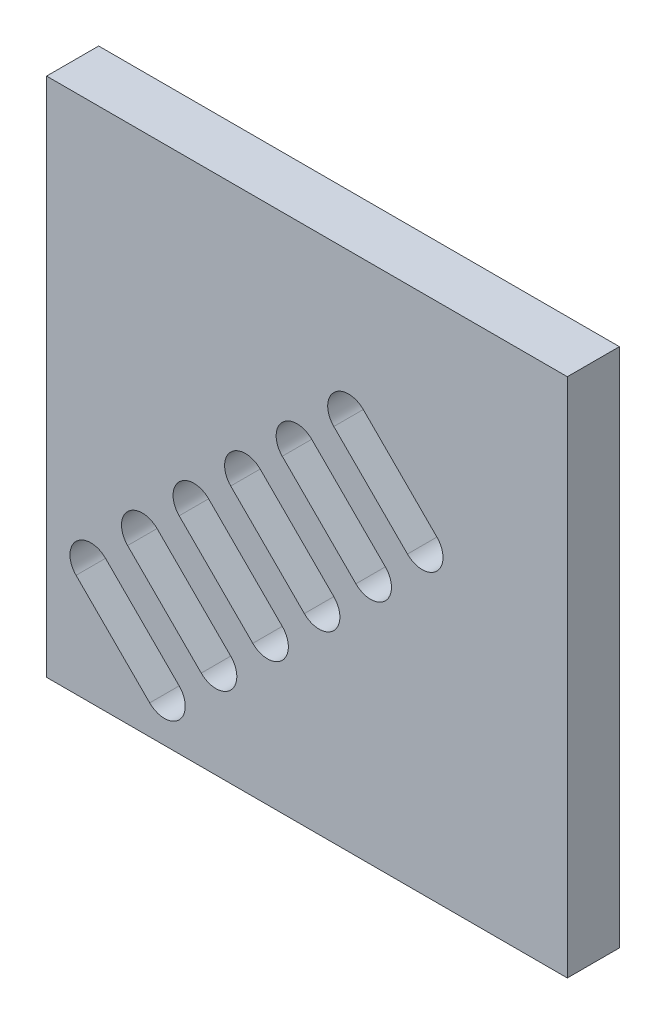
ISO-10303-21;
HEADER;
FILE_DESCRIPTION(('STEP AP214'),'2;1');
FILE_NAME('part.step','',(''),(''),'','','');
FILE_SCHEMA(('AUTOMOTIVE_DESIGN { 1 0 10303 214 1 1 1 1 }'));
ENDSEC;
DATA;
#1=APPLICATION_CONTEXT('core data for automotive mechanical design processes');
#2=APPLICATION_PROTOCOL_DEFINITION('international standard','automotive_design',2000,#1);
#3=PRODUCT_CONTEXT('',#1,'mechanical');
#4=PRODUCT('Part','Part','',(#3));
#5=PRODUCT_RELATED_PRODUCT_CATEGORY('part','',(#4));
#6=PRODUCT_DEFINITION_FORMATION('','',#4);
#7=PRODUCT_DEFINITION_CONTEXT('part definition',#1,'design');
#8=PRODUCT_DEFINITION('design','',#6,#7);
#9=PRODUCT_DEFINITION_SHAPE('','',#8);
#10=(LENGTH_UNIT() NAMED_UNIT(*) SI_UNIT(.MILLI.,.METRE.));
#11=(NAMED_UNIT(*) PLANE_ANGLE_UNIT() SI_UNIT($,.RADIAN.));
#12=(NAMED_UNIT(*) SI_UNIT($,.STERADIAN.) SOLID_ANGLE_UNIT());
#13=UNCERTAINTY_MEASURE_WITH_UNIT(LENGTH_MEASURE(1.E-05),#10,'distance_accuracy_value','');
#14=(GEOMETRIC_REPRESENTATION_CONTEXT(3) GLOBAL_UNCERTAINTY_ASSIGNED_CONTEXT((#13)) GLOBAL_UNIT_ASSIGNED_CONTEXT((#10,
#11,#12)) REPRESENTATION_CONTEXT('',''));
#15=CARTESIAN_POINT('',(0.,0.,0.));
#16=DIRECTION('',(0.,0.,1.));
#17=DIRECTION('',(1.,0.,0.));
#18=AXIS2_PLACEMENT_3D('',#15,#16,#17);
#19=CARTESIAN_POINT('',(10.8111831820431,24.953318805774,5.));
#20=DIRECTION('',(-0.707106781186547,-0.707106781186548,0.));
#21=DIRECTION('',(0.707106781186548,-0.707106781186547,0.));
#22=AXIS2_PLACEMENT_3D('',#19,#20,#21);
#23=PLANE('',#22);
#24=DIRECTION('',(-0.707106781186548,0.707106781186547,0.));
#25=VECTOR('',#24,1.);
#26=CARTESIAN_POINT('',(10.8111831820431,24.953318805774,-5.));
#27=LINE('',#26,#25);
#28=CARTESIAN_POINT('',(24.953318805774,10.8111831820431,-5.));
#29=VERTEX_POINT('',#28);
#30=CARTESIAN_POINT('',(10.8111831820431,24.953318805774,-5.));
#31=VERTEX_POINT('',#30);
#32=EDGE_CURVE('E44',#29,#31,#27,.T.);
#33=ORIENTED_EDGE('',*,*,#32,.F.);
#34=DIRECTION('',(0.,0.,-1.));
#35=VECTOR('',#34,1.);
#36=CARTESIAN_POINT('',(24.953318805774,10.8111831820431,5.));
#37=LINE('',#36,#35);
#38=CARTESIAN_POINT('',(24.953318805774,10.8111831820431,5.));
#39=VERTEX_POINT('',#38);
#40=EDGE_CURVE('E429',#39,#29,#37,.T.);
#41=ORIENTED_EDGE('',*,*,#40,.F.);
#42=DIRECTION('',(-0.707106781186548,0.707106781186547,0.));
#43=VECTOR('',#42,1.);
#44=CARTESIAN_POINT('',(10.8111831820431,24.953318805774,5.));
#45=LINE('',#44,#43);
#46=CARTESIAN_POINT('',(10.8111831820431,24.953318805774,5.));
#47=VERTEX_POINT('',#46);
#48=EDGE_CURVE('E11',#39,#47,#45,.T.);
#49=ORIENTED_EDGE('',*,*,#48,.T.);
#50=DIRECTION('',(0.,0.,-1.));
#51=VECTOR('',#50,1.);
#52=CARTESIAN_POINT('',(10.8111831820431,24.953318805774,5.));
#53=LINE('',#52,#51);
#54=EDGE_CURVE('E433',#47,#31,#53,.T.);
#55=ORIENTED_EDGE('',*,*,#54,.T.);
#56=EDGE_LOOP('',(#33,#41,#49,#55));
#57=FACE_BOUND('',#56,.T.);
#58=ADVANCED_FACE('F37',(#57),#23,.T.);
#59=CARTESIAN_POINT('',(5.1543289325507,19.2964645562816,5.));
#60=DIRECTION('',(0.707106781186548,0.707106781186547,0.));
#61=DIRECTION('',(-0.707106781186547,0.707106781186548,0.));
#62=AXIS2_PLACEMENT_3D('',#59,#60,#61);
#63=PLANE('',#62);
#64=DIRECTION('',(0.707106781186547,-0.707106781186548,0.));
#65=VECTOR('',#64,1.);
#66=CARTESIAN_POINT('',(5.1543289325507,19.2964645562816,-5.));
#67=LINE('',#66,#65);
#68=CARTESIAN_POINT('',(5.1543289325507,19.2964645562816,-5.));
#69=VERTEX_POINT('',#68);
#70=CARTESIAN_POINT('',(19.2964645562817,5.1543289325507,-5.));
#71=VERTEX_POINT('',#70);
#72=EDGE_CURVE('E439',#69,#71,#67,.T.);
#73=ORIENTED_EDGE('',*,*,#72,.F.);
#74=DIRECTION('',(0.,0.,-1.));
#75=VECTOR('',#74,1.);
#76=CARTESIAN_POINT('',(5.1543289325507,19.2964645562816,5.));
#77=LINE('',#76,#75);
#78=CARTESIAN_POINT('',(5.1543289325507,19.2964645562816,5.));
#79=VERTEX_POINT('',#78);
#80=EDGE_CURVE('E437',#79,#69,#77,.T.);
#81=ORIENTED_EDGE('',*,*,#80,.F.);
#82=DIRECTION('',(0.707106781186547,-0.707106781186548,0.));
#83=VECTOR('',#82,1.);
#84=CARTESIAN_POINT('',(5.1543289325507,19.2964645562816,5.));
#85=LINE('',#84,#83);
#86=CARTESIAN_POINT('',(19.2964645562817,5.1543289325507,5.));
#87=VERTEX_POINT('',#86);
#88=EDGE_CURVE('E441',#79,#87,#85,.T.);
#89=ORIENTED_EDGE('',*,*,#88,.T.);
#90=DIRECTION('',(0.,0.,-1.));
#91=VECTOR('',#90,1.);
#92=CARTESIAN_POINT('',(19.2964645562817,5.1543289325507,5.));
#93=LINE('',#92,#91);
#94=EDGE_CURVE('E424',#87,#71,#93,.T.);
#95=ORIENTED_EDGE('',*,*,#94,.T.);
#96=EDGE_LOOP('',(#73,#81,#89,#95));
#97=FACE_BOUND('',#96,.T.);
#98=ADVANCED_FACE('F456',(#97),#63,.T.);
#99=CARTESIAN_POINT('',(7.98275605729689,22.1248916810278,5.));
#100=DIRECTION('',(0.,0.,-1.));
#101=DIRECTION('',(-1.,0.,0.));
#102=AXIS2_PLACEMENT_3D('',#99,#100,#101);
#103=CYLINDRICAL_SURFACE('',#102,4.);
#104=CARTESIAN_POINT('',(7.98275605729689,22.1248916810278,-5.));
#105=DIRECTION('',(0.,0.,1.));
#106=DIRECTION('',(1.,0.,0.));
#107=AXIS2_PLACEMENT_3D('',#104,#105,#106);
#108=CIRCLE('',#107,4.);
#109=EDGE_CURVE('E51',#31,#69,#108,.T.);
#110=ORIENTED_EDGE('',*,*,#109,.F.);
#111=ORIENTED_EDGE('',*,*,#54,.F.);
#112=CARTESIAN_POINT('',(7.98275605729689,22.1248916810278,5.));
#113=DIRECTION('',(0.,0.,1.));
#114=DIRECTION('',(1.,0.,0.));
#115=AXIS2_PLACEMENT_3D('',#112,#113,#114);
#116=CIRCLE('',#115,4.);
#117=EDGE_CURVE('E58',#47,#79,#116,.T.);
#118=ORIENTED_EDGE('',*,*,#117,.T.);
#119=ORIENTED_EDGE('',*,*,#80,.T.);
#120=EDGE_LOOP('',(#110,#111,#118,#119));
#121=FACE_BOUND('',#120,.T.);
#122=ADVANCED_FACE('F449',(#121),#103,.F.);
#123=CARTESIAN_POINT('',(22.1248916810279,7.98275605729689,5.));
#124=DIRECTION('',(0.,0.,-1.));
#125=DIRECTION('',(-1.,0.,0.));
#126=AXIS2_PLACEMENT_3D('',#123,#124,#125);
#127=CYLINDRICAL_SURFACE('',#126,4.);
#128=CARTESIAN_POINT('',(22.1248916810279,7.98275605729689,-5.));
#129=DIRECTION('',(0.,0.,1.));
#130=DIRECTION('',(1.,0.,0.));
#131=AXIS2_PLACEMENT_3D('',#128,#129,#130);
#132=CIRCLE('',#131,4.);
#133=EDGE_CURVE('E422',#71,#29,#132,.T.);
#134=ORIENTED_EDGE('',*,*,#133,.F.);
#135=ORIENTED_EDGE('',*,*,#94,.F.);
#136=CARTESIAN_POINT('',(22.1248916810279,7.98275605729689,5.));
#137=DIRECTION('',(0.,0.,1.));
#138=DIRECTION('',(1.,0.,0.));
#139=AXIS2_PLACEMENT_3D('',#136,#137,#138);
#140=CIRCLE('',#139,4.);
#141=EDGE_CURVE('E427',#87,#39,#140,.T.);
#142=ORIENTED_EDGE('',*,*,#141,.T.);
#143=ORIENTED_EDGE('',*,*,#40,.T.);
#144=EDGE_LOOP('',(#134,#135,#142,#143));
#145=FACE_BOUND('',#144,.T.);
#146=ADVANCED_FACE('F458',(#145),#127,.F.);
#147=CARTESIAN_POINT('',(0.911688245431412,15.0538238691624,5.));
#148=DIRECTION('',(-0.707106781186547,-0.707106781186548,0.));
#149=DIRECTION('',(0.707106781186548,-0.707106781186547,0.));
#150=AXIS2_PLACEMENT_3D('',#147,#148,#149);
#151=PLANE('',#150);
#152=DIRECTION('',(-0.707106781186548,0.707106781186547,0.));
#153=VECTOR('',#152,1.);
#154=CARTESIAN_POINT('',(0.911688245431412,15.0538238691624,-5.));
#155=LINE('',#154,#153);
#156=CARTESIAN_POINT('',(15.0538238691624,0.911688245431412,-5.));
#157=VERTEX_POINT('',#156);
#158=CARTESIAN_POINT('',(0.911688245431412,15.0538238691624,-5.));
#159=VERTEX_POINT('',#158);
#160=EDGE_CURVE('E416',#157,#159,#155,.T.);
#161=ORIENTED_EDGE('',*,*,#160,.F.);
#162=DIRECTION('',(0.,0.,-1.));
#163=VECTOR('',#162,1.);
#164=CARTESIAN_POINT('',(15.0538238691624,0.911688245431412,5.));
#165=LINE('',#164,#163);
#166=CARTESIAN_POINT('',(15.0538238691624,0.911688245431412,5.));
#167=VERTEX_POINT('',#166);
#168=EDGE_CURVE('E397',#167,#157,#165,.T.);
#169=ORIENTED_EDGE('',*,*,#168,.F.);
#170=DIRECTION('',(-0.707106781186548,0.707106781186547,0.));
#171=VECTOR('',#170,1.);
#172=CARTESIAN_POINT('',(0.911688245431412,15.0538238691624,5.));
#173=LINE('',#172,#171);
#174=CARTESIAN_POINT('',(0.911688245431412,15.0538238691624,5.));
#175=VERTEX_POINT('',#174);
#176=EDGE_CURVE('E419',#167,#175,#173,.T.);
#177=ORIENTED_EDGE('',*,*,#176,.T.);
#178=DIRECTION('',(0.,0.,-1.));
#179=VECTOR('',#178,1.);
#180=CARTESIAN_POINT('',(0.911688245431412,15.0538238691624,5.));
#181=LINE('',#180,#179);
#182=EDGE_CURVE('E402',#175,#159,#181,.T.);
#183=ORIENTED_EDGE('',*,*,#182,.T.);
#184=EDGE_LOOP('',(#161,#169,#177,#183));
#185=FACE_BOUND('',#184,.T.);
#186=ADVANCED_FACE('F460',(#185),#151,.T.);
#187=CARTESIAN_POINT('',(-4.74516600406096,9.39696961966998,5.));
#188=DIRECTION('',(0.707106781186548,0.707106781186547,0.));
#189=DIRECTION('',(-0.707106781186547,0.707106781186548,0.));
#190=AXIS2_PLACEMENT_3D('',#187,#188,#189);
#191=PLANE('',#190);
#192=DIRECTION('',(0.707106781186547,-0.707106781186548,0.));
#193=VECTOR('',#192,1.);
#194=CARTESIAN_POINT('',(-4.74516600406096,9.39696961966998,-5.));
#195=LINE('',#194,#193);
#196=CARTESIAN_POINT('',(-4.74516600406096,9.39696961966998,-5.));
#197=VERTEX_POINT('',#196);
#198=CARTESIAN_POINT('',(9.39696961966999,-4.74516600406096,-5.));
#199=VERTEX_POINT('',#198);
#200=EDGE_CURVE('E410',#197,#199,#195,.T.);
#201=ORIENTED_EDGE('',*,*,#200,.F.);
#202=DIRECTION('',(0.,0.,-1.));
#203=VECTOR('',#202,1.);
#204=CARTESIAN_POINT('',(-4.74516600406096,9.39696961966998,5.));
#205=LINE('',#204,#203);
#206=CARTESIAN_POINT('',(-4.74516600406096,9.39696961966998,5.));
#207=VERTEX_POINT('',#206);
#208=EDGE_CURVE('E407',#207,#197,#205,.T.);
#209=ORIENTED_EDGE('',*,*,#208,.F.);
#210=DIRECTION('',(0.707106781186547,-0.707106781186548,0.));
#211=VECTOR('',#210,1.);
#212=CARTESIAN_POINT('',(-4.74516600406096,9.39696961966998,5.));
#213=LINE('',#212,#211);
#214=CARTESIAN_POINT('',(9.39696961966999,-4.74516600406096,5.));
#215=VERTEX_POINT('',#214);
#216=EDGE_CURVE('E413',#207,#215,#213,.T.);
#217=ORIENTED_EDGE('',*,*,#216,.T.);
#218=DIRECTION('',(0.,0.,-1.));
#219=VECTOR('',#218,1.);
#220=CARTESIAN_POINT('',(9.39696961966999,-4.74516600406096,5.));
#221=LINE('',#220,#219);
#222=EDGE_CURVE('E392',#215,#199,#221,.T.);
#223=ORIENTED_EDGE('',*,*,#222,.T.);
#224=EDGE_LOOP('',(#201,#209,#217,#223));
#225=FACE_BOUND('',#224,.T.);
#226=ADVANCED_FACE('F466',(#225),#191,.T.);
#227=CARTESIAN_POINT('',(-1.91673887931477,12.2253967444162,5.));
#228=DIRECTION('',(0.,0.,-1.));
#229=DIRECTION('',(-1.,0.,0.));
#230=AXIS2_PLACEMENT_3D('',#227,#228,#229);
#231=CYLINDRICAL_SURFACE('',#230,4.);
#232=CARTESIAN_POINT('',(-1.91673887931477,12.2253967444162,-5.));
#233=DIRECTION('',(0.,0.,1.));
#234=DIRECTION('',(1.,0.,0.));
#235=AXIS2_PLACEMENT_3D('',#232,#233,#234);
#236=CIRCLE('',#235,4.);
#237=EDGE_CURVE('E400',#159,#197,#236,.T.);
#238=ORIENTED_EDGE('',*,*,#237,.F.);
#239=ORIENTED_EDGE('',*,*,#182,.F.);
#240=CARTESIAN_POINT('',(-1.91673887931477,12.2253967444162,5.));
#241=DIRECTION('',(0.,0.,1.));
#242=DIRECTION('',(1.,0.,0.));
#243=AXIS2_PLACEMENT_3D('',#240,#241,#242);
#244=CIRCLE('',#243,4.);
#245=EDGE_CURVE('E405',#175,#207,#244,.T.);
#246=ORIENTED_EDGE('',*,*,#245,.T.);
#247=ORIENTED_EDGE('',*,*,#208,.T.);
#248=EDGE_LOOP('',(#238,#239,#246,#247));
#249=FACE_BOUND('',#248,.T.);
#250=ADVANCED_FACE('F499',(#249),#231,.F.);
#251=CARTESIAN_POINT('',(12.2253967444162,-1.91673887931477,5.));
#252=DIRECTION('',(0.,0.,-1.));
#253=DIRECTION('',(-1.,0.,0.));
#254=AXIS2_PLACEMENT_3D('',#251,#252,#253);
#255=CYLINDRICAL_SURFACE('',#254,4.);
#256=CARTESIAN_POINT('',(12.2253967444162,-1.91673887931477,-5.));
#257=DIRECTION('',(0.,0.,1.));
#258=DIRECTION('',(1.,0.,0.));
#259=AXIS2_PLACEMENT_3D('',#256,#257,#258);
#260=CIRCLE('',#259,4.);
#261=EDGE_CURVE('E390',#199,#157,#260,.T.);
#262=ORIENTED_EDGE('',*,*,#261,.F.);
#263=ORIENTED_EDGE('',*,*,#222,.F.);
#264=CARTESIAN_POINT('',(12.2253967444162,-1.91673887931477,5.));
#265=DIRECTION('',(0.,0.,1.));
#266=DIRECTION('',(1.,0.,0.));
#267=AXIS2_PLACEMENT_3D('',#264,#265,#266);
#268=CIRCLE('',#267,4.);
#269=EDGE_CURVE('E395',#215,#167,#268,.T.);
#270=ORIENTED_EDGE('',*,*,#269,.T.);
#271=ORIENTED_EDGE('',*,*,#168,.T.);
#272=EDGE_LOOP('',(#262,#263,#270,#271));
#273=FACE_BOUND('',#272,.T.);
#274=ADVANCED_FACE('F509',(#273),#255,.F.);
#275=CARTESIAN_POINT('',(-8.98780669118026,5.1543289325507,5.));
#276=DIRECTION('',(-0.707106781186547,-0.707106781186548,0.));
#277=DIRECTION('',(0.707106781186548,-0.707106781186547,0.));
#278=AXIS2_PLACEMENT_3D('',#275,#276,#277);
#279=PLANE('',#278);
#280=DIRECTION('',(-0.707106781186548,0.707106781186547,0.));
#281=VECTOR('',#280,1.);
#282=CARTESIAN_POINT('',(-8.98780669118026,5.1543289325507,-5.));
#283=LINE('',#282,#281);
#284=CARTESIAN_POINT('',(5.1543289325507,-8.98780669118025,-5.));
#285=VERTEX_POINT('',#284);
#286=CARTESIAN_POINT('',(-8.98780669118026,5.15432893255069,-5.));
#287=VERTEX_POINT('',#286);
#288=EDGE_CURVE('E384',#285,#287,#283,.T.);
#289=ORIENTED_EDGE('',*,*,#288,.F.);
#290=DIRECTION('',(0.,0.,-1.));
#291=VECTOR('',#290,1.);
#292=CARTESIAN_POINT('',(5.1543289325507,-8.98780669118025,5.));
#293=LINE('',#292,#291);
#294=CARTESIAN_POINT('',(5.1543289325507,-8.98780669118025,5.));
#295=VERTEX_POINT('',#294);
#296=EDGE_CURVE('E365',#295,#285,#293,.T.);
#297=ORIENTED_EDGE('',*,*,#296,.F.);
#298=DIRECTION('',(-0.707106781186548,0.707106781186547,0.));
#299=VECTOR('',#298,1.);
#300=CARTESIAN_POINT('',(-8.98780669118026,5.1543289325507,5.));
#301=LINE('',#300,#299);
#302=CARTESIAN_POINT('',(-8.98780669118026,5.1543289325507,5.));
#303=VERTEX_POINT('',#302);
#304=EDGE_CURVE('E387',#295,#303,#301,.T.);
#305=ORIENTED_EDGE('',*,*,#304,.T.);
#306=DIRECTION('',(0.,0.,-1.));
#307=VECTOR('',#306,1.);
#308=CARTESIAN_POINT('',(-8.98780669118026,5.1543289325507,5.));
#309=LINE('',#308,#307);
#310=EDGE_CURVE('E370',#303,#287,#309,.T.);
#311=ORIENTED_EDGE('',*,*,#310,.T.);
#312=EDGE_LOOP('',(#289,#297,#305,#311));
#313=FACE_BOUND('',#312,.T.);
#314=ADVANCED_FACE('F519',(#313),#279,.T.);
#315=CARTESIAN_POINT('',(-14.6446609406726,-0.502525316941681,5.));
#316=DIRECTION('',(0.707106781186548,0.707106781186547,0.));
#317=DIRECTION('',(-0.707106781186547,0.707106781186548,0.));
#318=AXIS2_PLACEMENT_3D('',#315,#316,#317);
#319=PLANE('',#318);
#320=DIRECTION('',(0.707106781186547,-0.707106781186548,0.));
#321=VECTOR('',#320,1.);
#322=CARTESIAN_POINT('',(-14.6446609406726,-0.502525316941681,-5.));
#323=LINE('',#322,#321);
#324=CARTESIAN_POINT('',(-14.6446609406726,-0.502525316941681,-5.));
#325=VERTEX_POINT('',#324);
#326=CARTESIAN_POINT('',(-0.502525316941674,-14.6446609406726,-5.));
#327=VERTEX_POINT('',#326);
#328=EDGE_CURVE('E378',#325,#327,#323,.T.);
#329=ORIENTED_EDGE('',*,*,#328,.F.);
#330=DIRECTION('',(0.,0.,-1.));
#331=VECTOR('',#330,1.);
#332=CARTESIAN_POINT('',(-14.6446609406726,-0.502525316941681,5.));
#333=LINE('',#332,#331);
#334=CARTESIAN_POINT('',(-14.6446609406726,-0.502525316941681,5.));
#335=VERTEX_POINT('',#334);
#336=EDGE_CURVE('E375',#335,#325,#333,.T.);
#337=ORIENTED_EDGE('',*,*,#336,.F.);
#338=DIRECTION('',(0.707106781186547,-0.707106781186548,0.));
#339=VECTOR('',#338,1.);
#340=CARTESIAN_POINT('',(-14.6446609406726,-0.502525316941681,5.));
#341=LINE('',#340,#339);
#342=CARTESIAN_POINT('',(-0.502525316941674,-14.6446609406726,5.));
#343=VERTEX_POINT('',#342);
#344=EDGE_CURVE('E381',#335,#343,#341,.T.);
#345=ORIENTED_EDGE('',*,*,#344,.T.);
#346=DIRECTION('',(0.,0.,-1.));
#347=VECTOR('',#346,1.);
#348=CARTESIAN_POINT('',(-0.502525316941674,-14.6446609406726,5.));
#349=LINE('',#348,#347);
#350=EDGE_CURVE('E360',#343,#327,#349,.T.);
#351=ORIENTED_EDGE('',*,*,#350,.T.);
#352=EDGE_LOOP('',(#329,#337,#345,#351));
#353=FACE_BOUND('',#352,.T.);
#354=ADVANCED_FACE('F529',(#353),#319,.T.);
#355=CARTESIAN_POINT('',(-11.8162338159264,2.32590180780451,5.));
#356=DIRECTION('',(0.,0.,-1.));
#357=DIRECTION('',(-1.,0.,0.));
#358=AXIS2_PLACEMENT_3D('',#355,#356,#357);
#359=CYLINDRICAL_SURFACE('',#358,4.);
#360=CARTESIAN_POINT('',(-11.8162338159264,2.32590180780451,-5.));
#361=DIRECTION('',(0.,0.,1.));
#362=DIRECTION('',(1.,0.,0.));
#363=AXIS2_PLACEMENT_3D('',#360,#361,#362);
#364=CIRCLE('',#363,4.);
#365=EDGE_CURVE('E368',#287,#325,#364,.T.);
#366=ORIENTED_EDGE('',*,*,#365,.F.);
#367=ORIENTED_EDGE('',*,*,#310,.F.);
#368=CARTESIAN_POINT('',(-11.8162338159264,2.32590180780451,5.));
#369=DIRECTION('',(0.,0.,1.));
#370=DIRECTION('',(1.,0.,0.));
#371=AXIS2_PLACEMENT_3D('',#368,#369,#370);
#372=CIRCLE('',#371,4.);
#373=EDGE_CURVE('E373',#303,#335,#372,.T.);
#374=ORIENTED_EDGE('',*,*,#373,.T.);
#375=ORIENTED_EDGE('',*,*,#336,.T.);
#376=EDGE_LOOP('',(#366,#367,#374,#375));
#377=FACE_BOUND('',#376,.T.);
#378=ADVANCED_FACE('F539',(#377),#359,.F.);
#379=CARTESIAN_POINT('',(2.32590180780452,-11.8162338159264,5.));
#380=DIRECTION('',(0.,0.,-1.));
#381=DIRECTION('',(-1.,0.,0.));
#382=AXIS2_PLACEMENT_3D('',#379,#380,#381);
#383=CYLINDRICAL_SURFACE('',#382,4.);
#384=CARTESIAN_POINT('',(2.32590180780452,-11.8162338159264,-5.));
#385=DIRECTION('',(0.,0.,1.));
#386=DIRECTION('',(1.,0.,0.));
#387=AXIS2_PLACEMENT_3D('',#384,#385,#386);
#388=CIRCLE('',#387,4.);
#389=EDGE_CURVE('E358',#327,#285,#388,.T.);
#390=ORIENTED_EDGE('',*,*,#389,.F.);
#391=ORIENTED_EDGE('',*,*,#350,.F.);
#392=CARTESIAN_POINT('',(2.32590180780452,-11.8162338159264,5.));
#393=DIRECTION('',(0.,0.,1.));
#394=DIRECTION('',(1.,0.,0.));
#395=AXIS2_PLACEMENT_3D('',#392,#393,#394);
#396=CIRCLE('',#395,4.);
#397=EDGE_CURVE('E363',#343,#295,#396,.T.);
#398=ORIENTED_EDGE('',*,*,#397,.T.);
#399=ORIENTED_EDGE('',*,*,#296,.T.);
#400=EDGE_LOOP('',(#390,#391,#398,#399));
#401=FACE_BOUND('',#400,.T.);
#402=ADVANCED_FACE('F549',(#401),#383,.F.);
#403=CARTESIAN_POINT('',(-18.8873016277919,-4.74516600406097,5.));
#404=DIRECTION('',(-0.707106781186547,-0.707106781186548,0.));
#405=DIRECTION('',(0.707106781186548,-0.707106781186547,0.));
#406=AXIS2_PLACEMENT_3D('',#403,#404,#405);
#407=PLANE('',#406);
#408=DIRECTION('',(-0.707106781186548,0.707106781186547,0.));
#409=VECTOR('',#408,1.);
#410=CARTESIAN_POINT('',(-18.8873016277919,-4.74516600406097,-5.));
#411=LINE('',#410,#409);
#412=CARTESIAN_POINT('',(-4.74516600406096,-18.8873016277919,-5.));
#413=VERTEX_POINT('',#412);
#414=CARTESIAN_POINT('',(-18.8873016277919,-4.74516600406097,-5.));
#415=VERTEX_POINT('',#414);
#416=EDGE_CURVE('E352',#413,#415,#411,.T.);
#417=ORIENTED_EDGE('',*,*,#416,.F.);
#418=DIRECTION('',(0.,0.,-1.));
#419=VECTOR('',#418,1.);
#420=CARTESIAN_POINT('',(-4.74516600406096,-18.8873016277919,5.));
#421=LINE('',#420,#419);
#422=CARTESIAN_POINT('',(-4.74516600406097,-18.8873016277919,5.));
#423=VERTEX_POINT('',#422);
#424=EDGE_CURVE('E333',#423,#413,#421,.T.);
#425=ORIENTED_EDGE('',*,*,#424,.F.);
#426=DIRECTION('',(-0.707106781186548,0.707106781186547,0.));
#427=VECTOR('',#426,1.);
#428=CARTESIAN_POINT('',(-18.8873016277919,-4.74516600406097,5.));
#429=LINE('',#428,#427);
#430=CARTESIAN_POINT('',(-18.8873016277919,-4.74516600406097,5.));
#431=VERTEX_POINT('',#430);
#432=EDGE_CURVE('E355',#423,#431,#429,.T.);
#433=ORIENTED_EDGE('',*,*,#432,.T.);
#434=DIRECTION('',(0.,0.,-1.));
#435=VECTOR('',#434,1.);
#436=CARTESIAN_POINT('',(-18.8873016277919,-4.74516600406097,5.));
#437=LINE('',#436,#435);
#438=EDGE_CURVE('E338',#431,#415,#437,.T.);
#439=ORIENTED_EDGE('',*,*,#438,.T.);
#440=EDGE_LOOP('',(#417,#425,#433,#439));
#441=FACE_BOUND('',#440,.T.);
#442=ADVANCED_FACE('F559',(#441),#407,.T.);
#443=CARTESIAN_POINT('',(-24.5441558772843,-10.4020202535533,5.));
#444=DIRECTION('',(0.707106781186548,0.707106781186547,0.));
#445=DIRECTION('',(-0.707106781186547,0.707106781186548,0.));
#446=AXIS2_PLACEMENT_3D('',#443,#444,#445);
#447=PLANE('',#446);
#448=DIRECTION('',(0.707106781186547,-0.707106781186548,0.));
#449=VECTOR('',#448,1.);
#450=CARTESIAN_POINT('',(-24.5441558772843,-10.4020202535533,-5.));
#451=LINE('',#450,#449);
#452=CARTESIAN_POINT('',(-24.5441558772843,-10.4020202535533,-5.));
#453=VERTEX_POINT('',#452);
#454=CARTESIAN_POINT('',(-10.4020202535533,-24.5441558772843,-5.));
#455=VERTEX_POINT('',#454);
#456=EDGE_CURVE('E346',#453,#455,#451,.T.);
#457=ORIENTED_EDGE('',*,*,#456,.F.);
#458=DIRECTION('',(0.,0.,-1.));
#459=VECTOR('',#458,1.);
#460=CARTESIAN_POINT('',(-24.5441558772843,-10.4020202535533,5.));
#461=LINE('',#460,#459);
#462=CARTESIAN_POINT('',(-24.5441558772843,-10.4020202535533,5.));
#463=VERTEX_POINT('',#462);
#464=EDGE_CURVE('E343',#463,#453,#461,.T.);
#465=ORIENTED_EDGE('',*,*,#464,.F.);
#466=DIRECTION('',(0.707106781186547,-0.707106781186548,0.));
#467=VECTOR('',#466,1.);
#468=CARTESIAN_POINT('',(-24.5441558772843,-10.4020202535533,5.));
#469=LINE('',#468,#467);
#470=CARTESIAN_POINT('',(-10.4020202535533,-24.5441558772843,5.));
#471=VERTEX_POINT('',#470);
#472=EDGE_CURVE('E349',#463,#471,#469,.T.);
#473=ORIENTED_EDGE('',*,*,#472,.T.);
#474=DIRECTION('',(0.,0.,-1.));
#475=VECTOR('',#474,1.);
#476=CARTESIAN_POINT('',(-10.4020202535533,-24.5441558772843,5.));
#477=LINE('',#476,#475);
#478=EDGE_CURVE('E328',#471,#455,#477,.T.);
#479=ORIENTED_EDGE('',*,*,#478,.T.);
#480=EDGE_LOOP('',(#457,#465,#473,#479));
#481=FACE_BOUND('',#480,.T.);
#482=ADVANCED_FACE('F569',(#481),#447,.T.);
#483=CARTESIAN_POINT('',(-21.7157287525381,-7.57359312880716,5.));
#484=DIRECTION('',(0.,0.,-1.));
#485=DIRECTION('',(-1.,0.,0.));
#486=AXIS2_PLACEMENT_3D('',#483,#484,#485);
#487=CYLINDRICAL_SURFACE('',#486,4.);
#488=CARTESIAN_POINT('',(-21.7157287525381,-7.57359312880716,-5.));
#489=DIRECTION('',(0.,0.,1.));
#490=DIRECTION('',(1.,0.,0.));
#491=AXIS2_PLACEMENT_3D('',#488,#489,#490);
#492=CIRCLE('',#491,4.);
#493=EDGE_CURVE('E336',#415,#453,#492,.T.);
#494=ORIENTED_EDGE('',*,*,#493,.F.);
#495=ORIENTED_EDGE('',*,*,#438,.F.);
#496=CARTESIAN_POINT('',(-21.7157287525381,-7.57359312880716,5.));
#497=DIRECTION('',(0.,0.,1.));
#498=DIRECTION('',(1.,0.,0.));
#499=AXIS2_PLACEMENT_3D('',#496,#497,#498);
#500=CIRCLE('',#499,4.);
#501=EDGE_CURVE('E341',#431,#463,#500,.T.);
#502=ORIENTED_EDGE('',*,*,#501,.T.);
#503=ORIENTED_EDGE('',*,*,#464,.T.);
#504=EDGE_LOOP('',(#494,#495,#502,#503));
#505=FACE_BOUND('',#504,.T.);
#506=ADVANCED_FACE('F579',(#505),#487,.F.);
#507=CARTESIAN_POINT('',(-7.57359312880715,-21.7157287525381,5.));
#508=DIRECTION('',(0.,0.,-1.));
#509=DIRECTION('',(-1.,0.,0.));
#510=AXIS2_PLACEMENT_3D('',#507,#508,#509);
#511=CYLINDRICAL_SURFACE('',#510,4.);
#512=CARTESIAN_POINT('',(-7.57359312880715,-21.7157287525381,-5.));
#513=DIRECTION('',(0.,0.,1.));
#514=DIRECTION('',(1.,0.,0.));
#515=AXIS2_PLACEMENT_3D('',#512,#513,#514);
#516=CIRCLE('',#515,4.);
#517=EDGE_CURVE('E326',#455,#413,#516,.T.);
#518=ORIENTED_EDGE('',*,*,#517,.F.);
#519=ORIENTED_EDGE('',*,*,#478,.F.);
#520=CARTESIAN_POINT('',(-7.57359312880715,-21.7157287525381,5.));
#521=DIRECTION('',(0.,0.,1.));
#522=DIRECTION('',(1.,0.,0.));
#523=AXIS2_PLACEMENT_3D('',#520,#521,#522);
#524=CIRCLE('',#523,4.);
#525=EDGE_CURVE('E331',#471,#423,#524,.T.);
#526=ORIENTED_EDGE('',*,*,#525,.T.);
#527=ORIENTED_EDGE('',*,*,#424,.T.);
#528=EDGE_LOOP('',(#518,#519,#526,#527));
#529=FACE_BOUND('',#528,.T.);
#530=ADVANCED_FACE('F589',(#529),#511,.F.);
#531=CARTESIAN_POINT('',(-28.7867965644036,-14.6446609406726,5.));
#532=DIRECTION('',(-0.707106781186547,-0.707106781186548,0.));
#533=DIRECTION('',(0.707106781186548,-0.707106781186547,0.));
#534=AXIS2_PLACEMENT_3D('',#531,#532,#533);
#535=PLANE('',#534);
#536=DIRECTION('',(-0.707106781186548,0.707106781186547,0.));
#537=VECTOR('',#536,1.);
#538=CARTESIAN_POINT('',(-28.7867965644036,-14.6446609406726,-5.));
#539=LINE('',#538,#537);
#540=CARTESIAN_POINT('',(-14.6446609406726,-28.7867965644036,-5.));
#541=VERTEX_POINT('',#540);
#542=CARTESIAN_POINT('',(-28.7867965644036,-14.6446609406726,-5.));
#543=VERTEX_POINT('',#542);
#544=EDGE_CURVE('E320',#541,#543,#539,.T.);
#545=ORIENTED_EDGE('',*,*,#544,.F.);
#546=DIRECTION('',(0.,0.,-1.));
#547=VECTOR('',#546,1.);
#548=CARTESIAN_POINT('',(-14.6446609406726,-28.7867965644036,5.));
#549=LINE('',#548,#547);
#550=CARTESIAN_POINT('',(-14.6446609406726,-28.7867965644036,5.));
#551=VERTEX_POINT('',#550);
#552=EDGE_CURVE('E301',#551,#541,#549,.T.);
#553=ORIENTED_EDGE('',*,*,#552,.F.);
#554=DIRECTION('',(-0.707106781186548,0.707106781186547,0.));
#555=VECTOR('',#554,1.);
#556=CARTESIAN_POINT('',(-28.7867965644036,-14.6446609406726,5.));
#557=LINE('',#556,#555);
#558=CARTESIAN_POINT('',(-28.7867965644036,-14.6446609406726,5.));
#559=VERTEX_POINT('',#558);
#560=EDGE_CURVE('E323',#551,#559,#557,.T.);
#561=ORIENTED_EDGE('',*,*,#560,.T.);
#562=DIRECTION('',(0.,0.,-1.));
#563=VECTOR('',#562,1.);
#564=CARTESIAN_POINT('',(-28.7867965644036,-14.6446609406726,5.));
#565=LINE('',#564,#563);
#566=EDGE_CURVE('E306',#559,#543,#565,.T.);
#567=ORIENTED_EDGE('',*,*,#566,.T.);
#568=EDGE_LOOP('',(#545,#553,#561,#567));
#569=FACE_BOUND('',#568,.T.);
#570=ADVANCED_FACE('F599',(#569),#535,.T.);
#571=CARTESIAN_POINT('',(-34.443650813896,-20.301515190165,5.));
#572=DIRECTION('',(0.707106781186548,0.707106781186547,0.));
#573=DIRECTION('',(-0.707106781186547,0.707106781186548,0.));
#574=AXIS2_PLACEMENT_3D('',#571,#572,#573);
#575=PLANE('',#574);
#576=DIRECTION('',(0.707106781186547,-0.707106781186548,0.));
#577=VECTOR('',#576,1.);
#578=CARTESIAN_POINT('',(-34.443650813896,-20.301515190165,-5.));
#579=LINE('',#578,#577);
#580=CARTESIAN_POINT('',(-34.443650813896,-20.301515190165,-5.));
#581=VERTEX_POINT('',#580);
#582=CARTESIAN_POINT('',(-20.301515190165,-34.443650813896,-5.));
#583=VERTEX_POINT('',#582);
#584=EDGE_CURVE('E314',#581,#583,#579,.T.);
#585=ORIENTED_EDGE('',*,*,#584,.F.);
#586=DIRECTION('',(0.,0.,-1.));
#587=VECTOR('',#586,1.);
#588=CARTESIAN_POINT('',(-34.443650813896,-20.301515190165,5.));
#589=LINE('',#588,#587);
#590=CARTESIAN_POINT('',(-34.443650813896,-20.301515190165,5.));
#591=VERTEX_POINT('',#590);
#592=EDGE_CURVE('E311',#591,#581,#589,.T.);
#593=ORIENTED_EDGE('',*,*,#592,.F.);
#594=DIRECTION('',(0.707106781186547,-0.707106781186548,0.));
#595=VECTOR('',#594,1.);
#596=CARTESIAN_POINT('',(-34.443650813896,-20.301515190165,5.));
#597=LINE('',#596,#595);
#598=CARTESIAN_POINT('',(-20.301515190165,-34.443650813896,5.));
#599=VERTEX_POINT('',#598);
#600=EDGE_CURVE('E317',#591,#599,#597,.T.);
#601=ORIENTED_EDGE('',*,*,#600,.T.);
#602=DIRECTION('',(0.,0.,-1.));
#603=VECTOR('',#602,1.);
#604=CARTESIAN_POINT('',(-20.301515190165,-34.443650813896,5.));
#605=LINE('',#604,#603);
#606=EDGE_CURVE('E296',#599,#583,#605,.T.);
#607=ORIENTED_EDGE('',*,*,#606,.T.);
#608=EDGE_LOOP('',(#585,#593,#601,#607));
#609=FACE_BOUND('',#608,.T.);
#610=ADVANCED_FACE('F609',(#609),#575,.T.);
#611=CARTESIAN_POINT('',(-31.6152236891498,-17.4730880654188,5.));
#612=DIRECTION('',(0.,0.,-1.));
#613=DIRECTION('',(-1.,0.,0.));
#614=AXIS2_PLACEMENT_3D('',#611,#612,#613);
#615=CYLINDRICAL_SURFACE('',#614,4.);
#616=CARTESIAN_POINT('',(-31.6152236891498,-17.4730880654188,-5.));
#617=DIRECTION('',(0.,0.,1.));
#618=DIRECTION('',(1.,0.,0.));
#619=AXIS2_PLACEMENT_3D('',#616,#617,#618);
#620=CIRCLE('',#619,4.);
#621=EDGE_CURVE('E304',#543,#581,#620,.T.);
#622=ORIENTED_EDGE('',*,*,#621,.F.);
#623=ORIENTED_EDGE('',*,*,#566,.F.);
#624=CARTESIAN_POINT('',(-31.6152236891498,-17.4730880654188,5.));
#625=DIRECTION('',(0.,0.,1.));
#626=DIRECTION('',(1.,0.,0.));
#627=AXIS2_PLACEMENT_3D('',#624,#625,#626);
#628=CIRCLE('',#627,4.);
#629=EDGE_CURVE('E309',#559,#591,#628,.T.);
#630=ORIENTED_EDGE('',*,*,#629,.T.);
#631=ORIENTED_EDGE('',*,*,#592,.T.);
#632=EDGE_LOOP('',(#622,#623,#630,#631));
#633=FACE_BOUND('',#632,.T.);
#634=ADVANCED_FACE('F619',(#633),#615,.F.);
#635=CARTESIAN_POINT('',(-17.4730880654188,-31.6152236891498,5.));
#636=DIRECTION('',(0.,0.,-1.));
#637=DIRECTION('',(-1.,0.,0.));
#638=AXIS2_PLACEMENT_3D('',#635,#636,#637);
#639=CYLINDRICAL_SURFACE('',#638,4.);
#640=CARTESIAN_POINT('',(-17.4730880654188,-31.6152236891498,-5.));
#641=DIRECTION('',(0.,0.,1.));
#642=DIRECTION('',(1.,0.,0.));
#643=AXIS2_PLACEMENT_3D('',#640,#641,#642);
#644=CIRCLE('',#643,4.);
#645=EDGE_CURVE('E294',#583,#541,#644,.T.);
#646=ORIENTED_EDGE('',*,*,#645,.F.);
#647=ORIENTED_EDGE('',*,*,#606,.F.);
#648=CARTESIAN_POINT('',(-17.4730880654188,-31.6152236891498,5.));
#649=DIRECTION('',(0.,0.,1.));
#650=DIRECTION('',(1.,0.,0.));
#651=AXIS2_PLACEMENT_3D('',#648,#649,#650);
#652=CIRCLE('',#651,4.);
#653=EDGE_CURVE('E299',#599,#551,#652,.T.);
#654=ORIENTED_EDGE('',*,*,#653,.T.);
#655=ORIENTED_EDGE('',*,*,#552,.T.);
#656=EDGE_LOOP('',(#646,#647,#654,#655));
#657=FACE_BOUND('',#656,.T.);
#658=ADVANCED_FACE('F629',(#657),#639,.F.);
#659=CARTESIAN_POINT('',(0.,0.,5.));
#660=DIRECTION('',(0.,0.,-1.));
#661=DIRECTION('',(-1.,0.,0.));
#662=AXIS2_PLACEMENT_3D('',#659,#660,#661);
#663=PLANE('',#662);
#664=ORIENTED_EDGE('',*,*,#117,.F.);
#665=ORIENTED_EDGE('',*,*,#48,.F.);
#666=ORIENTED_EDGE('',*,*,#141,.F.);
#667=ORIENTED_EDGE('',*,*,#88,.F.);
#668=EDGE_LOOP('',(#664,#665,#666,#667));
#669=FACE_BOUND('',#668,.T.);
#670=ORIENTED_EDGE('',*,*,#245,.F.);
#671=ORIENTED_EDGE('',*,*,#176,.F.);
#672=ORIENTED_EDGE('',*,*,#269,.F.);
#673=ORIENTED_EDGE('',*,*,#216,.F.);
#674=EDGE_LOOP('',(#670,#671,#672,#673));
#675=FACE_BOUND('',#674,.T.);
#676=ORIENTED_EDGE('',*,*,#373,.F.);
#677=ORIENTED_EDGE('',*,*,#304,.F.);
#678=ORIENTED_EDGE('',*,*,#397,.F.);
#679=ORIENTED_EDGE('',*,*,#344,.F.);
#680=EDGE_LOOP('',(#676,#677,#678,#679));
#681=FACE_BOUND('',#680,.T.);
#682=ORIENTED_EDGE('',*,*,#501,.F.);
#683=ORIENTED_EDGE('',*,*,#432,.F.);
#684=ORIENTED_EDGE('',*,*,#525,.F.);
#685=ORIENTED_EDGE('',*,*,#472,.F.);
#686=EDGE_LOOP('',(#682,#683,#684,#685));
#687=FACE_BOUND('',#686,.T.);
#688=ORIENTED_EDGE('',*,*,#629,.F.);
#689=ORIENTED_EDGE('',*,*,#560,.F.);
#690=ORIENTED_EDGE('',*,*,#653,.F.);
#691=ORIENTED_EDGE('',*,*,#600,.F.);
#692=EDGE_LOOP('',(#688,#689,#690,#691));
#693=FACE_BOUND('',#692,.T.);
#694=DIRECTION('',(0.,1.,0.));
#695=VECTOR('',#694,1.);
#696=CARTESIAN_POINT('',(50.,-50.,5.));
#697=LINE('',#696,#695);
#698=CARTESIAN_POINT('',(50.,-50.,5.));
#699=VERTEX_POINT('',#698);
#700=CARTESIAN_POINT('',(50.,50.,5.));
#701=VERTEX_POINT('',#700);
#702=EDGE_CURVE('E265',#699,#701,#697,.T.);
#703=ORIENTED_EDGE('',*,*,#702,.T.);
#704=DIRECTION('',(-1.,0.,0.));
#705=VECTOR('',#704,1.);
#706=CARTESIAN_POINT('',(-50.,50.,5.));
#707=LINE('',#706,#705);
#708=CARTESIAN_POINT('',(-50.,50.,5.));
#709=VERTEX_POINT('',#708);
#710=EDGE_CURVE('E268',#701,#709,#707,.T.);
#711=ORIENTED_EDGE('',*,*,#710,.T.);
#712=DIRECTION('',(0.,-1.,0.));
#713=VECTOR('',#712,1.);
#714=CARTESIAN_POINT('',(-50.,-50.,5.));
#715=LINE('',#714,#713);
#716=CARTESIAN_POINT('',(-50.,-50.,5.));
#717=VERTEX_POINT('',#716);
#718=EDGE_CURVE('E271',#709,#717,#715,.T.);
#719=ORIENTED_EDGE('',*,*,#718,.T.);
#720=DIRECTION('',(1.,0.,0.));
#721=VECTOR('',#720,1.);
#722=CARTESIAN_POINT('',(-50.,-50.,5.));
#723=LINE('',#722,#721);
#724=EDGE_CURVE('E273',#717,#699,#723,.T.);
#725=ORIENTED_EDGE('',*,*,#724,.T.);
#726=EDGE_LOOP('',(#703,#711,#719,#725));
#727=FACE_BOUND('',#726,.T.);
#728=CARTESIAN_POINT('',(-41.5147186257614,-27.3725830020305,5.));
#729=DIRECTION('',(0.,0.,1.));
#730=DIRECTION('',(1.,0.,0.));
#731=AXIS2_PLACEMENT_3D('',#728,#729,#730);
#732=CIRCLE('',#731,4.);
#733=CARTESIAN_POINT('',(-38.6862915010153,-24.5441558772843,5.));
#734=VERTEX_POINT('',#733);
#735=CARTESIAN_POINT('',(-44.3431457505076,-30.2010101267767,5.));
#736=VERTEX_POINT('',#735);
#737=EDGE_CURVE('E223',#734,#736,#732,.T.);
#738=ORIENTED_EDGE('',*,*,#737,.F.);
#739=DIRECTION('',(-0.707106781186548,0.707106781186547,0.));
#740=VECTOR('',#739,1.);
#741=CARTESIAN_POINT('',(-38.6862915010153,-24.5441558772843,5.));
#742=LINE('',#741,#740);
#743=CARTESIAN_POINT('',(-24.5441558772843,-38.6862915010152,5.));
#744=VERTEX_POINT('',#743);
#745=EDGE_CURVE('E249',#744,#734,#742,.T.);
#746=ORIENTED_EDGE('',*,*,#745,.F.);
#747=CARTESIAN_POINT('',(-27.3725830020305,-41.5147186257614,5.));
#748=DIRECTION('',(0.,0.,1.));
#749=DIRECTION('',(1.,0.,0.));
#750=AXIS2_PLACEMENT_3D('',#747,#748,#749);
#751=CIRCLE('',#750,4.);
#752=CARTESIAN_POINT('',(-30.2010101267767,-44.3431457505076,5.));
#753=VERTEX_POINT('',#752);
#754=EDGE_CURVE('E247',#753,#744,#751,.T.);
#755=ORIENTED_EDGE('',*,*,#754,.F.);
#756=DIRECTION('',(0.707106781186547,-0.707106781186548,0.));
#757=VECTOR('',#756,1.);
#758=CARTESIAN_POINT('',(-44.3431457505076,-30.2010101267767,5.));
#759=LINE('',#758,#757);
#760=EDGE_CURVE('E233',#736,#753,#759,.T.);
#761=ORIENTED_EDGE('',*,*,#760,.F.);
#762=EDGE_LOOP('',(#738,#746,#755,#761));
#763=FACE_BOUND('',#762,.T.);
#764=ADVANCED_FACE('F245',(#669,#675,#681,#687,#693,#727,#763),#663,.F.);
#765=CARTESIAN_POINT('',(0.,0.,-5.));
#766=DIRECTION('',(0.,0.,-1.));
#767=DIRECTION('',(-1.,0.,0.));
#768=AXIS2_PLACEMENT_3D('',#765,#766,#767);
#769=PLANE('',#768);
#770=ORIENTED_EDGE('',*,*,#32,.T.);
#771=ORIENTED_EDGE('',*,*,#109,.T.);
#772=ORIENTED_EDGE('',*,*,#72,.T.);
#773=ORIENTED_EDGE('',*,*,#133,.T.);
#774=EDGE_LOOP('',(#770,#771,#772,#773));
#775=FACE_BOUND('',#774,.T.);
#776=ORIENTED_EDGE('',*,*,#160,.T.);
#777=ORIENTED_EDGE('',*,*,#237,.T.);
#778=ORIENTED_EDGE('',*,*,#200,.T.);
#779=ORIENTED_EDGE('',*,*,#261,.T.);
#780=EDGE_LOOP('',(#776,#777,#778,#779));
#781=FACE_BOUND('',#780,.T.);
#782=ORIENTED_EDGE('',*,*,#288,.T.);
#783=ORIENTED_EDGE('',*,*,#365,.T.);
#784=ORIENTED_EDGE('',*,*,#328,.T.);
#785=ORIENTED_EDGE('',*,*,#389,.T.);
#786=EDGE_LOOP('',(#782,#783,#784,#785));
#787=FACE_BOUND('',#786,.T.);
#788=ORIENTED_EDGE('',*,*,#416,.T.);
#789=ORIENTED_EDGE('',*,*,#493,.T.);
#790=ORIENTED_EDGE('',*,*,#456,.T.);
#791=ORIENTED_EDGE('',*,*,#517,.T.);
#792=EDGE_LOOP('',(#788,#789,#790,#791));
#793=FACE_BOUND('',#792,.T.);
#794=ORIENTED_EDGE('',*,*,#544,.T.);
#795=ORIENTED_EDGE('',*,*,#621,.T.);
#796=ORIENTED_EDGE('',*,*,#584,.T.);
#797=ORIENTED_EDGE('',*,*,#645,.T.);
#798=EDGE_LOOP('',(#794,#795,#796,#797));
#799=FACE_BOUND('',#798,.T.);
#800=DIRECTION('',(0.,1.,0.));
#801=VECTOR('',#800,1.);
#802=CARTESIAN_POINT('',(50.,-50.,-5.));
#803=LINE('',#802,#801);
#804=CARTESIAN_POINT('',(50.,-50.,-5.));
#805=VERTEX_POINT('',#804);
#806=CARTESIAN_POINT('',(50.,50.,-5.));
#807=VERTEX_POINT('',#806);
#808=EDGE_CURVE('E241',#805,#807,#803,.T.);
#809=ORIENTED_EDGE('',*,*,#808,.F.);
#810=DIRECTION('',(1.,0.,0.));
#811=VECTOR('',#810,1.);
#812=CARTESIAN_POINT('',(-50.,-50.,-5.));
#813=LINE('',#812,#811);
#814=CARTESIAN_POINT('',(-50.,-50.,-5.));
#815=VERTEX_POINT('',#814);
#816=EDGE_CURVE('E269',#815,#805,#813,.T.);
#817=ORIENTED_EDGE('',*,*,#816,.F.);
#818=DIRECTION('',(0.,-1.,0.));
#819=VECTOR('',#818,1.);
#820=CARTESIAN_POINT('',(-50.,-50.,-5.));
#821=LINE('',#820,#819);
#822=CARTESIAN_POINT('',(-50.,50.,-5.));
#823=VERTEX_POINT('',#822);
#824=EDGE_CURVE('E280',#823,#815,#821,.T.);
#825=ORIENTED_EDGE('',*,*,#824,.F.);
#826=DIRECTION('',(-1.,0.,0.));
#827=VECTOR('',#826,1.);
#828=CARTESIAN_POINT('',(-50.,50.,-5.));
#829=LINE('',#828,#827);
#830=EDGE_CURVE('E278',#807,#823,#829,.T.);
#831=ORIENTED_EDGE('',*,*,#830,.F.);
#832=EDGE_LOOP('',(#809,#817,#825,#831));
#833=FACE_BOUND('',#832,.T.);
#834=DIRECTION('',(-0.707106781186548,0.707106781186547,0.));
#835=VECTOR('',#834,1.);
#836=CARTESIAN_POINT('',(-38.6862915010153,-24.5441558772843,-5.));
#837=LINE('',#836,#835);
#838=CARTESIAN_POINT('',(-24.5441558772843,-38.6862915010152,-5.));
#839=VERTEX_POINT('',#838);
#840=CARTESIAN_POINT('',(-38.6862915010153,-24.5441558772843,-5.));
#841=VERTEX_POINT('',#840);
#842=EDGE_CURVE('E234',#839,#841,#837,.T.);
#843=ORIENTED_EDGE('',*,*,#842,.T.);
#844=CARTESIAN_POINT('',(-41.5147186257614,-27.3725830020305,-5.));
#845=DIRECTION('',(0.,0.,1.));
#846=DIRECTION('',(1.,0.,0.));
#847=AXIS2_PLACEMENT_3D('',#844,#845,#846);
#848=CIRCLE('',#847,4.);
#849=CARTESIAN_POINT('',(-44.3431457505076,-30.2010101267767,-5.));
#850=VERTEX_POINT('',#849);
#851=EDGE_CURVE('E253',#841,#850,#848,.T.);
#852=ORIENTED_EDGE('',*,*,#851,.T.);
#853=DIRECTION('',(0.707106781186547,-0.707106781186548,0.));
#854=VECTOR('',#853,1.);
#855=CARTESIAN_POINT('',(-44.3431457505076,-30.2010101267767,-5.));
#856=LINE('',#855,#854);
#857=CARTESIAN_POINT('',(-30.2010101267767,-44.3431457505076,-5.));
#858=VERTEX_POINT('',#857);
#859=EDGE_CURVE('E240',#850,#858,#856,.T.);
#860=ORIENTED_EDGE('',*,*,#859,.T.);
#861=CARTESIAN_POINT('',(-27.3725830020305,-41.5147186257614,-5.));
#862=DIRECTION('',(0.,0.,1.));
#863=DIRECTION('',(1.,0.,0.));
#864=AXIS2_PLACEMENT_3D('',#861,#862,#863);
#865=CIRCLE('',#864,4.);
#866=EDGE_CURVE('E256',#858,#839,#865,.T.);
#867=ORIENTED_EDGE('',*,*,#866,.T.);
#868=EDGE_LOOP('',(#843,#852,#860,#867));
#869=FACE_BOUND('',#868,.T.);
#870=ADVANCED_FACE('F444',(#775,#781,#787,#793,#799,#833,#869),#769,.T.);
#871=CARTESIAN_POINT('',(50.,-50.,5.));
#872=DIRECTION('',(-1.,0.,0.));
#873=DIRECTION('',(0.,0.,1.));
#874=AXIS2_PLACEMENT_3D('',#871,#872,#873);
#875=PLANE('',#874);
#876=ORIENTED_EDGE('',*,*,#808,.T.);
#877=DIRECTION('',(0.,0.,-1.));
#878=VECTOR('',#877,1.);
#879=CARTESIAN_POINT('',(50.,50.,5.));
#880=LINE('',#879,#878);
#881=EDGE_CURVE('E291',#701,#807,#880,.T.);
#882=ORIENTED_EDGE('',*,*,#881,.F.);
#883=ORIENTED_EDGE('',*,*,#702,.F.);
#884=DIRECTION('',(0.,0.,-1.));
#885=VECTOR('',#884,1.);
#886=CARTESIAN_POINT('',(50.,-50.,5.));
#887=LINE('',#886,#885);
#888=EDGE_CURVE('E275',#699,#805,#887,.T.);
#889=ORIENTED_EDGE('',*,*,#888,.T.);
#890=EDGE_LOOP('',(#876,#882,#883,#889));
#891=FACE_BOUND('',#890,.T.);
#892=ADVANCED_FACE('F655',(#891),#875,.F.);
#893=CARTESIAN_POINT('',(-50.,50.,5.));
#894=DIRECTION('',(0.,-1.,0.));
#895=DIRECTION('',(0.,0.,-1.));
#896=AXIS2_PLACEMENT_3D('',#893,#894,#895);
#897=PLANE('',#896);
#898=ORIENTED_EDGE('',*,*,#830,.T.);
#899=DIRECTION('',(0.,0.,-1.));
#900=VECTOR('',#899,1.);
#901=CARTESIAN_POINT('',(-50.,50.,5.));
#902=LINE('',#901,#900);
#903=EDGE_CURVE('E288',#709,#823,#902,.T.);
#904=ORIENTED_EDGE('',*,*,#903,.F.);
#905=ORIENTED_EDGE('',*,*,#710,.F.);
#906=ORIENTED_EDGE('',*,*,#881,.T.);
#907=EDGE_LOOP('',(#898,#904,#905,#906));
#908=FACE_BOUND('',#907,.T.);
#909=ADVANCED_FACE('F665',(#908),#897,.F.);
#910=CARTESIAN_POINT('',(-50.,-50.,5.));
#911=DIRECTION('',(1.,0.,0.));
#912=DIRECTION('',(0.,0.,-1.));
#913=AXIS2_PLACEMENT_3D('',#910,#911,#912);
#914=PLANE('',#913);
#915=ORIENTED_EDGE('',*,*,#824,.T.);
#916=DIRECTION('',(0.,0.,-1.));
#917=VECTOR('',#916,1.);
#918=CARTESIAN_POINT('',(-50.,-50.,5.));
#919=LINE('',#918,#917);
#920=EDGE_CURVE('E285',#717,#815,#919,.T.);
#921=ORIENTED_EDGE('',*,*,#920,.F.);
#922=ORIENTED_EDGE('',*,*,#718,.F.);
#923=ORIENTED_EDGE('',*,*,#903,.T.);
#924=EDGE_LOOP('',(#915,#921,#922,#923));
#925=FACE_BOUND('',#924,.T.);
#926=ADVANCED_FACE('F672',(#925),#914,.F.);
#927=CARTESIAN_POINT('',(-50.,-50.,5.));
#928=DIRECTION('',(0.,1.,0.));
#929=DIRECTION('',(0.,0.,1.));
#930=AXIS2_PLACEMENT_3D('',#927,#928,#929);
#931=PLANE('',#930);
#932=ORIENTED_EDGE('',*,*,#816,.T.);
#933=ORIENTED_EDGE('',*,*,#888,.F.);
#934=ORIENTED_EDGE('',*,*,#724,.F.);
#935=ORIENTED_EDGE('',*,*,#920,.T.);
#936=EDGE_LOOP('',(#932,#933,#934,#935));
#937=FACE_BOUND('',#936,.T.);
#938=ADVANCED_FACE('F680',(#937),#931,.F.);
#939=CARTESIAN_POINT('',(-41.5147186257614,-27.3725830020305,5.));
#940=DIRECTION('',(0.,0.,-1.));
#941=DIRECTION('',(-1.,0.,0.));
#942=AXIS2_PLACEMENT_3D('',#939,#940,#941);
#943=CYLINDRICAL_SURFACE('',#942,4.);
#944=ORIENTED_EDGE('',*,*,#851,.F.);
#945=DIRECTION('',(0.,0.,-1.));
#946=VECTOR('',#945,1.);
#947=CARTESIAN_POINT('',(-38.6862915010153,-24.5441558772843,5.));
#948=LINE('',#947,#946);
#949=EDGE_CURVE('E229',#734,#841,#948,.T.);
#950=ORIENTED_EDGE('',*,*,#949,.F.);
#951=ORIENTED_EDGE('',*,*,#737,.T.);
#952=DIRECTION('',(0.,0.,-1.));
#953=VECTOR('',#952,1.);
#954=CARTESIAN_POINT('',(-44.3431457505076,-30.2010101267767,5.));
#955=LINE('',#954,#953);
#956=EDGE_CURVE('E226',#736,#850,#955,.T.);
#957=ORIENTED_EDGE('',*,*,#956,.T.);
#958=EDGE_LOOP('',(#944,#950,#951,#957));
#959=FACE_BOUND('',#958,.T.);
#960=ADVANCED_FACE('F225',(#959),#943,.F.);
#961=CARTESIAN_POINT('',(-44.3431457505076,-30.2010101267767,5.));
#962=DIRECTION('',(0.707106781186548,0.707106781186547,0.));
#963=DIRECTION('',(-0.707106781186547,0.707106781186548,0.));
#964=AXIS2_PLACEMENT_3D('',#961,#962,#963);
#965=PLANE('',#964);
#966=ORIENTED_EDGE('',*,*,#859,.F.);
#967=ORIENTED_EDGE('',*,*,#956,.F.);
#968=ORIENTED_EDGE('',*,*,#760,.T.);
#969=DIRECTION('',(0.,0.,-1.));
#970=VECTOR('',#969,1.);
#971=CARTESIAN_POINT('',(-30.2010101267767,-44.3431457505076,5.));
#972=LINE('',#971,#970);
#973=EDGE_CURVE('E242',#753,#858,#972,.T.);
#974=ORIENTED_EDGE('',*,*,#973,.T.);
#975=EDGE_LOOP('',(#966,#967,#968,#974));
#976=FACE_BOUND('',#975,.T.);
#977=ADVANCED_FACE('F237',(#976),#965,.T.);
#978=CARTESIAN_POINT('',(-27.3725830020305,-41.5147186257614,5.));
#979=DIRECTION('',(0.,0.,-1.));
#980=DIRECTION('',(-1.,0.,0.));
#981=AXIS2_PLACEMENT_3D('',#978,#979,#980);
#982=CYLINDRICAL_SURFACE('',#981,4.);
#983=ORIENTED_EDGE('',*,*,#866,.F.);
#984=ORIENTED_EDGE('',*,*,#973,.F.);
#985=ORIENTED_EDGE('',*,*,#754,.T.);
#986=DIRECTION('',(0.,0.,-1.));
#987=VECTOR('',#986,1.);
#988=CARTESIAN_POINT('',(-24.5441558772843,-38.6862915010152,5.));
#989=LINE('',#988,#987);
#990=EDGE_CURVE('E262',#744,#839,#989,.T.);
#991=ORIENTED_EDGE('',*,*,#990,.T.);
#992=EDGE_LOOP('',(#983,#984,#985,#991));
#993=FACE_BOUND('',#992,.T.);
#994=ADVANCED_FACE('F701',(#993),#982,.F.);
#995=CARTESIAN_POINT('',(-38.6862915010153,-24.5441558772843,5.));
#996=DIRECTION('',(-0.707106781186547,-0.707106781186548,0.));
#997=DIRECTION('',(0.707106781186548,-0.707106781186547,0.));
#998=AXIS2_PLACEMENT_3D('',#995,#996,#997);
#999=PLANE('',#998);
#1000=ORIENTED_EDGE('',*,*,#842,.F.);
#1001=ORIENTED_EDGE('',*,*,#990,.F.);
#1002=ORIENTED_EDGE('',*,*,#745,.T.);
#1003=ORIENTED_EDGE('',*,*,#949,.T.);
#1004=EDGE_LOOP('',(#1000,#1001,#1002,#1003));
#1005=FACE_BOUND('',#1004,.T.);
#1006=ADVANCED_FACE('F708',(#1005),#999,.T.);
#1007=CLOSED_SHELL('',(#58,#98,#122,#146,#186,#226,#250,#274,#314,#354,#378,#402,#442,#482,#506,
#530,#570,#610,#634,#658,#764,#870,#892,#909,#926,#938,#960,#977,#994,#1006));
#1008=MANIFOLD_SOLID_BREP('B2',#1007);
#1009=ADVANCED_BREP_SHAPE_REPRESENTATION('',(#18,#1008),#14);
#1010=SHAPE_DEFINITION_REPRESENTATION(#9,#1009);
ENDSEC;
END-ISO-10303-21;
